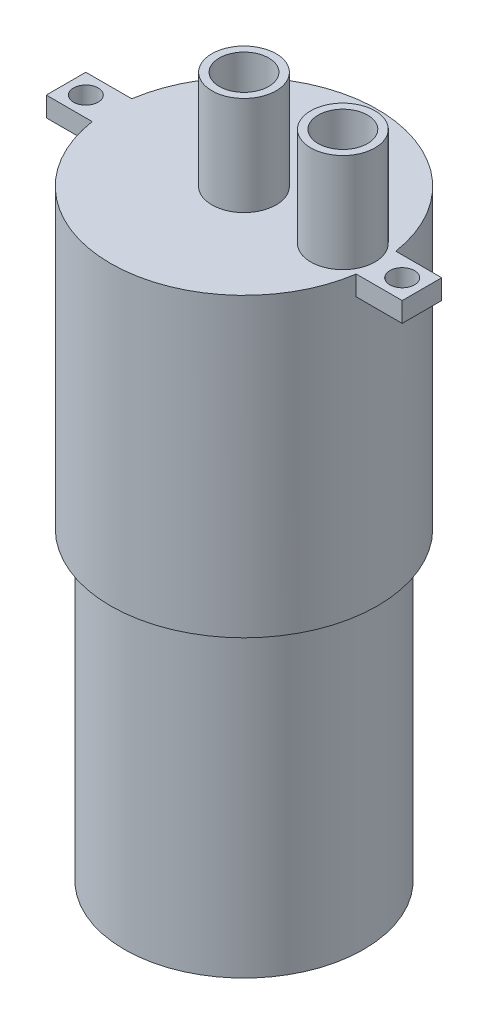
ISO-10303-21;
HEADER;
FILE_DESCRIPTION(('STEP AP214'),'2;1');
FILE_NAME('part.step','',(''),(''),'','','');
FILE_SCHEMA(('AUTOMOTIVE_DESIGN { 1 0 10303 214 1 1 1 1 }'));
ENDSEC;
DATA;
#1=APPLICATION_CONTEXT('core data for automotive mechanical design processes');
#2=APPLICATION_PROTOCOL_DEFINITION('international standard','automotive_design',2000,#1);
#3=PRODUCT_CONTEXT('',#1,'mechanical');
#4=PRODUCT('Part','Part','',(#3));
#5=PRODUCT_RELATED_PRODUCT_CATEGORY('part','',(#4));
#6=PRODUCT_DEFINITION_FORMATION('','',#4);
#7=PRODUCT_DEFINITION_CONTEXT('part definition',#1,'design');
#8=PRODUCT_DEFINITION('design','',#6,#7);
#9=PRODUCT_DEFINITION_SHAPE('','',#8);
#10=(LENGTH_UNIT() NAMED_UNIT(*) SI_UNIT(.MILLI.,.METRE.));
#11=(NAMED_UNIT(*) PLANE_ANGLE_UNIT() SI_UNIT($,.RADIAN.));
#12=(NAMED_UNIT(*) SI_UNIT($,.STERADIAN.) SOLID_ANGLE_UNIT());
#13=UNCERTAINTY_MEASURE_WITH_UNIT(LENGTH_MEASURE(1.E-05),#10,'distance_accuracy_value','');
#14=(GEOMETRIC_REPRESENTATION_CONTEXT(3) GLOBAL_UNCERTAINTY_ASSIGNED_CONTEXT((#13)) GLOBAL_UNIT_ASSIGNED_CONTEXT((#10,
#11,#12)) REPRESENTATION_CONTEXT('',''));
#15=CARTESIAN_POINT('',(0.,0.,0.));
#16=DIRECTION('',(0.,0.,1.));
#17=DIRECTION('',(1.,0.,0.));
#18=AXIS2_PLACEMENT_3D('',#15,#16,#17);
#19=CARTESIAN_POINT('',(0.,0.,0.));
#20=DIRECTION('',(0.,1.,0.));
#21=DIRECTION('',(0.,0.,1.));
#22=AXIS2_PLACEMENT_3D('',#19,#20,#21);
#23=PLANE('',#22);
#24=CARTESIAN_POINT('',(0.,0.,0.));
#25=DIRECTION('',(0.,1.,0.));
#26=DIRECTION('',(0.,0.,1.));
#27=AXIS2_PLACEMENT_3D('',#24,#25,#26);
#28=CIRCLE('',#27,12.1);
#29=CARTESIAN_POINT('',(0.,0.,12.1));
#30=VERTEX_POINT('',#29);
#31=EDGE_CURVE('E43',#30,#30,#28,.T.);
#32=ORIENTED_EDGE('',*,*,#31,.F.);
#33=EDGE_LOOP('',(#32));
#34=FACE_BOUND('',#33,.T.);
#35=ADVANCED_FACE('F36',(#34),#23,.F.);
#36=CARTESIAN_POINT('',(0.,12.3804050456273,0.));
#37=DIRECTION('',(0.,1.,0.));
#38=DIRECTION('',(0.,0.,1.));
#39=AXIS2_PLACEMENT_3D('',#36,#37,#38);
#40=CYLINDRICAL_SURFACE('',#39,12.1);
#41=CARTESIAN_POINT('',(0.,30.8,0.));
#42=DIRECTION('',(0.,1.,0.));
#43=DIRECTION('',(0.,0.,1.));
#44=AXIS2_PLACEMENT_3D('',#41,#42,#43);
#45=CIRCLE('',#44,12.1);
#46=CARTESIAN_POINT('',(0.,30.8,12.1));
#47=VERTEX_POINT('',#46);
#48=EDGE_CURVE('E202',#47,#47,#45,.T.);
#49=ORIENTED_EDGE('',*,*,#48,.F.);
#50=EDGE_LOOP('',(#49));
#51=FACE_BOUND('',#50,.T.);
#52=ORIENTED_EDGE('',*,*,#31,.T.);
#53=EDGE_LOOP('',(#52));
#54=FACE_BOUND('',#53,.T.);
#55=ADVANCED_FACE('F207',(#51,#54),#40,.T.);
#56=CARTESIAN_POINT('',(12.1,30.8,0.));
#57=DIRECTION('',(0.,1.,0.));
#58=DIRECTION('',(0.,0.,1.));
#59=AXIS2_PLACEMENT_3D('',#56,#57,#58);
#60=PLANE('',#59);
#61=CARTESIAN_POINT('',(0.,30.8,0.));
#62=DIRECTION('',(0.,1.,0.));
#63=DIRECTION('',(0.,0.,1.));
#64=AXIS2_PLACEMENT_3D('',#61,#62,#63);
#65=CIRCLE('',#64,13.5);
#66=CARTESIAN_POINT('',(0.,30.8,13.5));
#67=VERTEX_POINT('',#66);
#68=EDGE_CURVE('E199',#67,#67,#65,.T.);
#69=ORIENTED_EDGE('',*,*,#68,.F.);
#70=EDGE_LOOP('',(#69));
#71=FACE_BOUND('',#70,.T.);
#72=ORIENTED_EDGE('',*,*,#48,.T.);
#73=EDGE_LOOP('',(#72));
#74=FACE_BOUND('',#73,.T.);
#75=ADVANCED_FACE('F213',(#71,#74),#60,.F.);
#76=CARTESIAN_POINT('',(0.,12.3804050456273,0.));
#77=DIRECTION('',(0.,1.,0.));
#78=DIRECTION('',(0.,0.,1.));
#79=AXIS2_PLACEMENT_3D('',#76,#77,#78);
#80=CYLINDRICAL_SURFACE('',#79,13.5);
#81=CARTESIAN_POINT('',(0.,58.8,0.));
#82=DIRECTION('',(0.,-1.,0.));
#83=DIRECTION('',(0.,0.,1.));
#84=AXIS2_PLACEMENT_3D('',#81,#82,#83);
#85=CIRCLE('',#84,13.5);
#86=CARTESIAN_POINT('',(13.3510299228187,58.8,-2.));
#87=VERTEX_POINT('',#86);
#88=CARTESIAN_POINT('',(13.3510299228187,58.8,2.));
#89=VERTEX_POINT('',#88);
#90=EDGE_CURVE('E119',#87,#89,#85,.T.);
#91=ORIENTED_EDGE('',*,*,#90,.T.);
#92=DIRECTION('',(0.,1.,0.));
#93=VECTOR('',#92,1.);
#94=CARTESIAN_POINT('',(13.3510299228187,58.8,2.));
#95=LINE('',#94,#93);
#96=CARTESIAN_POINT('',(13.3510299228187,60.8,2.));
#97=VERTEX_POINT('',#96);
#98=EDGE_CURVE('E139',#89,#97,#95,.T.);
#99=ORIENTED_EDGE('',*,*,#98,.T.);
#100=CARTESIAN_POINT('',(0.,60.8,0.));
#101=DIRECTION('',(0.,1.,0.));
#102=DIRECTION('',(0.,0.,1.));
#103=AXIS2_PLACEMENT_3D('',#100,#101,#102);
#104=CIRCLE('',#103,13.5);
#105=CARTESIAN_POINT('',(-13.3510299228187,60.8,2.));
#106=VERTEX_POINT('',#105);
#107=EDGE_CURVE('E197',#106,#97,#104,.T.);
#108=ORIENTED_EDGE('',*,*,#107,.F.);
#109=DIRECTION('',(0.,1.,0.));
#110=VECTOR('',#109,1.);
#111=CARTESIAN_POINT('',(-13.3510299228187,58.8,1.99999999999999));
#112=LINE('',#111,#110);
#113=CARTESIAN_POINT('',(-13.3510299228187,58.8,1.99999999999999));
#114=VERTEX_POINT('',#113);
#115=EDGE_CURVE('E173',#114,#106,#112,.T.);
#116=ORIENTED_EDGE('',*,*,#115,.F.);
#117=CARTESIAN_POINT('',(0.,58.8,0.));
#118=DIRECTION('',(0.,-1.,0.));
#119=DIRECTION('',(0.,0.,1.));
#120=AXIS2_PLACEMENT_3D('',#117,#118,#119);
#121=CIRCLE('',#120,13.5);
#122=CARTESIAN_POINT('',(-13.3510299228187,58.8,-2.));
#123=VERTEX_POINT('',#122);
#124=EDGE_CURVE('E156',#114,#123,#121,.T.);
#125=ORIENTED_EDGE('',*,*,#124,.T.);
#126=DIRECTION('',(0.,1.,0.));
#127=VECTOR('',#126,1.);
#128=CARTESIAN_POINT('',(-13.3510299228187,58.8,-2.));
#129=LINE('',#128,#127);
#130=CARTESIAN_POINT('',(-13.3510299228187,60.8,-2.));
#131=VERTEX_POINT('',#130);
#132=EDGE_CURVE('E170',#123,#131,#129,.T.);
#133=ORIENTED_EDGE('',*,*,#132,.T.);
#134=CARTESIAN_POINT('',(13.3510299228187,60.8,-2.));
#135=VERTEX_POINT('',#134);
#136=EDGE_CURVE('E196',#135,#131,#104,.T.);
#137=ORIENTED_EDGE('',*,*,#136,.F.);
#138=DIRECTION('',(0.,1.,0.));
#139=VECTOR('',#138,1.);
#140=CARTESIAN_POINT('',(13.3510299228187,58.8,-2.));
#141=LINE('',#140,#139);
#142=EDGE_CURVE('E109',#87,#135,#141,.T.);
#143=ORIENTED_EDGE('',*,*,#142,.F.);
#144=EDGE_LOOP('',(#91,#99,#108,#116,#125,#133,#137,#143));
#145=FACE_BOUND('',#144,.T.);
#146=ORIENTED_EDGE('',*,*,#68,.T.);
#147=EDGE_LOOP('',(#146));
#148=FACE_BOUND('',#147,.T.);
#149=ADVANCED_FACE('F218',(#145,#148),#80,.T.);
#150=CARTESIAN_POINT('',(13.5,60.8,0.));
#151=DIRECTION('',(0.,-1.,0.));
#152=DIRECTION('',(0.,0.,-1.));
#153=AXIS2_PLACEMENT_3D('',#150,#151,#152);
#154=PLANE('',#153);
#155=CARTESIAN_POINT('',(10.,60.8,0.));
#156=DIRECTION('',(0.,-1.,0.));
#157=DIRECTION('',(0.,0.,-1.));
#158=AXIS2_PLACEMENT_3D('',#155,#156,#157);
#159=CIRCLE('',#158,3.25);
#160=CARTESIAN_POINT('',(10.,60.8,-3.25));
#161=VERTEX_POINT('',#160);
#162=EDGE_CURVE('E11',#161,#161,#159,.F.);
#163=ORIENTED_EDGE('',*,*,#162,.F.);
#164=EDGE_LOOP('',(#163));
#165=FACE_BOUND('',#164,.T.);
#166=CARTESIAN_POINT('',(0.,60.8,0.));
#167=DIRECTION('',(0.,1.,0.));
#168=DIRECTION('',(0.,0.,1.));
#169=AXIS2_PLACEMENT_3D('',#166,#167,#168);
#170=CIRCLE('',#169,3.25);
#171=CARTESIAN_POINT('',(0.,60.8,3.25));
#172=VERTEX_POINT('',#171);
#173=EDGE_CURVE('E193',#172,#172,#170,.T.);
#174=ORIENTED_EDGE('',*,*,#173,.F.);
#175=EDGE_LOOP('',(#174));
#176=FACE_BOUND('',#175,.T.);
#177=ORIENTED_EDGE('',*,*,#107,.T.);
#178=DIRECTION('',(1.,0.,0.));
#179=VECTOR('',#178,1.);
#180=CARTESIAN_POINT('',(18.,60.8,2.));
#181=LINE('',#180,#179);
#182=CARTESIAN_POINT('',(18.,60.8,2.));
#183=VERTEX_POINT('',#182);
#184=EDGE_CURVE('E123',#97,#183,#181,.T.);
#185=ORIENTED_EDGE('',*,*,#184,.T.);
#186=DIRECTION('',(0.,0.,-1.));
#187=VECTOR('',#186,1.);
#188=CARTESIAN_POINT('',(18.,60.8,2.));
#189=LINE('',#188,#187);
#190=CARTESIAN_POINT('',(18.,60.8,-2.));
#191=VERTEX_POINT('',#190);
#192=EDGE_CURVE('E133',#183,#191,#189,.T.);
#193=ORIENTED_EDGE('',*,*,#192,.T.);
#194=DIRECTION('',(-1.,0.,0.));
#195=VECTOR('',#194,1.);
#196=CARTESIAN_POINT('',(18.,60.8,-2.));
#197=LINE('',#196,#195);
#198=EDGE_CURVE('E50',#191,#135,#197,.T.);
#199=ORIENTED_EDGE('',*,*,#198,.T.);
#200=ORIENTED_EDGE('',*,*,#136,.T.);
#201=DIRECTION('',(-1.,0.,0.));
#202=VECTOR('',#201,1.);
#203=CARTESIAN_POINT('',(-13.3510299228187,60.8,-2.));
#204=LINE('',#203,#202);
#205=CARTESIAN_POINT('',(-18.,60.8,-2.));
#206=VERTEX_POINT('',#205);
#207=EDGE_CURVE('E153',#131,#206,#204,.T.);
#208=ORIENTED_EDGE('',*,*,#207,.T.);
#209=DIRECTION('',(0.,0.,1.));
#210=VECTOR('',#209,1.);
#211=CARTESIAN_POINT('',(-18.,60.8,2.));
#212=LINE('',#211,#210);
#213=CARTESIAN_POINT('',(-18.,60.8,2.));
#214=VERTEX_POINT('',#213);
#215=EDGE_CURVE('E146',#206,#214,#212,.T.);
#216=ORIENTED_EDGE('',*,*,#215,.T.);
#217=DIRECTION('',(1.,0.,0.));
#218=VECTOR('',#217,1.);
#219=CARTESIAN_POINT('',(-13.3510299228187,60.8,2.));
#220=LINE('',#219,#218);
#221=EDGE_CURVE('E57',#214,#106,#220,.T.);
#222=ORIENTED_EDGE('',*,*,#221,.T.);
#223=EDGE_LOOP('',(#177,#185,#193,#199,#200,#208,#216,#222));
#224=FACE_BOUND('',#223,.T.);
#225=CARTESIAN_POINT('',(-16.,60.8,0.));
#226=DIRECTION('',(0.,1.,0.));
#227=DIRECTION('',(0.,0.,1.));
#228=AXIS2_PLACEMENT_3D('',#225,#226,#227);
#229=CIRCLE('',#228,1.25);
#230=CARTESIAN_POINT('',(-16.,60.8,1.25));
#231=VERTEX_POINT('',#230);
#232=EDGE_CURVE('E138',#231,#231,#229,.T.);
#233=ORIENTED_EDGE('',*,*,#232,.F.);
#234=EDGE_LOOP('',(#233));
#235=FACE_BOUND('',#234,.T.);
#236=CARTESIAN_POINT('',(16.,60.8,0.));
#237=DIRECTION('',(0.,1.,0.));
#238=DIRECTION('',(0.,0.,1.));
#239=AXIS2_PLACEMENT_3D('',#236,#237,#238);
#240=CIRCLE('',#239,1.25);
#241=CARTESIAN_POINT('',(16.,60.8,1.25));
#242=VERTEX_POINT('',#241);
#243=EDGE_CURVE('E128',#242,#242,#240,.T.);
#244=ORIENTED_EDGE('',*,*,#243,.F.);
#245=EDGE_LOOP('',(#244));
#246=FACE_BOUND('',#245,.T.);
#247=ADVANCED_FACE('F225',(#165,#176,#224,#235,#246),#154,.F.);
#248=CARTESIAN_POINT('',(0.,12.3804050456273,0.));
#249=DIRECTION('',(0.,1.,0.));
#250=DIRECTION('',(0.,0.,1.));
#251=AXIS2_PLACEMENT_3D('',#248,#249,#250);
#252=CYLINDRICAL_SURFACE('',#251,3.25);
#253=CARTESIAN_POINT('',(0.,70.8,0.));
#254=DIRECTION('',(0.,1.,0.));
#255=DIRECTION('',(0.,0.,1.));
#256=AXIS2_PLACEMENT_3D('',#253,#254,#255);
#257=CIRCLE('',#256,3.24999999999999);
#258=CARTESIAN_POINT('',(0.,70.8,3.24999999999999));
#259=VERTEX_POINT('',#258);
#260=EDGE_CURVE('E190',#259,#259,#257,.T.);
#261=ORIENTED_EDGE('',*,*,#260,.F.);
#262=EDGE_LOOP('',(#261));
#263=FACE_BOUND('',#262,.T.);
#264=ORIENTED_EDGE('',*,*,#173,.T.);
#265=EDGE_LOOP('',(#264));
#266=FACE_BOUND('',#265,.T.);
#267=ADVANCED_FACE('F229',(#263,#266),#252,.T.);
#268=CARTESIAN_POINT('',(3.24999999999999,70.8,0.));
#269=DIRECTION('',(0.,-1.,0.));
#270=DIRECTION('',(0.,0.,-1.));
#271=AXIS2_PLACEMENT_3D('',#268,#269,#270);
#272=PLANE('',#271);
#273=CARTESIAN_POINT('',(0.,70.8,0.));
#274=DIRECTION('',(0.,1.,0.));
#275=DIRECTION('',(0.,0.,1.));
#276=AXIS2_PLACEMENT_3D('',#273,#274,#275);
#277=CIRCLE('',#276,2.49999999999999);
#278=CARTESIAN_POINT('',(0.,70.8,2.49999999999999));
#279=VERTEX_POINT('',#278);
#280=EDGE_CURVE('E187',#279,#279,#277,.T.);
#281=ORIENTED_EDGE('',*,*,#280,.F.);
#282=EDGE_LOOP('',(#281));
#283=FACE_BOUND('',#282,.T.);
#284=ORIENTED_EDGE('',*,*,#260,.T.);
#285=EDGE_LOOP('',(#284));
#286=FACE_BOUND('',#285,.T.);
#287=ADVANCED_FACE('F234',(#283,#286),#272,.F.);
#288=CARTESIAN_POINT('',(0.,12.3804050456273,0.));
#289=DIRECTION('',(0.,1.,0.));
#290=DIRECTION('',(0.,0.,1.));
#291=AXIS2_PLACEMENT_3D('',#288,#289,#290);
#292=CYLINDRICAL_SURFACE('',#291,2.49999999999999);
#293=CARTESIAN_POINT('',(0.,62.8,0.));
#294=DIRECTION('',(0.,1.,0.));
#295=DIRECTION('',(0.,0.,1.));
#296=AXIS2_PLACEMENT_3D('',#293,#294,#295);
#297=CIRCLE('',#296,2.5);
#298=CARTESIAN_POINT('',(0.,62.8,2.5));
#299=VERTEX_POINT('',#298);
#300=EDGE_CURVE('E184',#299,#299,#297,.T.);
#301=ORIENTED_EDGE('',*,*,#300,.F.);
#302=EDGE_LOOP('',(#301));
#303=FACE_BOUND('',#302,.T.);
#304=ORIENTED_EDGE('',*,*,#280,.T.);
#305=EDGE_LOOP('',(#304));
#306=FACE_BOUND('',#305,.T.);
#307=ADVANCED_FACE('F238',(#303,#306),#292,.F.);
#308=CARTESIAN_POINT('',(2.5,62.8,0.));
#309=DIRECTION('',(0.,-1.,0.));
#310=DIRECTION('',(0.,0.,-1.));
#311=AXIS2_PLACEMENT_3D('',#308,#309,#310);
#312=PLANE('',#311);
#313=ORIENTED_EDGE('',*,*,#300,.T.);
#314=EDGE_LOOP('',(#313));
#315=FACE_BOUND('',#314,.T.);
#316=ADVANCED_FACE('F242',(#315),#312,.F.);
#317=CARTESIAN_POINT('',(10.,79.9923881554251,0.));
#318=DIRECTION('',(0.,-1.,0.));
#319=DIRECTION('',(0.,0.,-1.));
#320=AXIS2_PLACEMENT_3D('',#317,#318,#319);
#321=CYLINDRICAL_SURFACE('',#320,3.25);
#322=CARTESIAN_POINT('',(10.,70.8,0.));
#323=DIRECTION('',(0.,-1.,0.));
#324=DIRECTION('',(0.,0.,-1.));
#325=AXIS2_PLACEMENT_3D('',#322,#323,#324);
#326=CIRCLE('',#325,3.25);
#327=CARTESIAN_POINT('',(10.,70.8,-3.25));
#328=VERTEX_POINT('',#327);
#329=EDGE_CURVE('E178',#328,#328,#326,.T.);
#330=ORIENTED_EDGE('',*,*,#329,.T.);
#331=EDGE_LOOP('',(#330));
#332=FACE_BOUND('',#331,.T.);
#333=ORIENTED_EDGE('',*,*,#162,.T.);
#334=EDGE_LOOP('',(#333));
#335=FACE_BOUND('',#334,.T.);
#336=ADVANCED_FACE('F246',(#332,#335),#321,.T.);
#337=CARTESIAN_POINT('',(10.,79.9923881554251,0.));
#338=DIRECTION('',(0.,-1.,0.));
#339=DIRECTION('',(0.,0.,-1.));
#340=AXIS2_PLACEMENT_3D('',#337,#338,#339);
#341=CYLINDRICAL_SURFACE('',#340,2.49999999999999);
#342=CARTESIAN_POINT('',(10.,70.8,0.));
#343=DIRECTION('',(0.,-1.,0.));
#344=DIRECTION('',(0.,0.,-1.));
#345=AXIS2_PLACEMENT_3D('',#342,#343,#344);
#346=CIRCLE('',#345,2.49999999999999);
#347=CARTESIAN_POINT('',(10.,70.8,-2.49999999999999));
#348=VERTEX_POINT('',#347);
#349=EDGE_CURVE('E181',#348,#348,#346,.T.);
#350=ORIENTED_EDGE('',*,*,#349,.F.);
#351=EDGE_LOOP('',(#350));
#352=FACE_BOUND('',#351,.T.);
#353=CARTESIAN_POINT('',(10.,60.8,0.));
#354=DIRECTION('',(0.,1.,0.));
#355=DIRECTION('',(0.,0.,1.));
#356=AXIS2_PLACEMENT_3D('',#353,#354,#355);
#357=CIRCLE('',#356,2.49999999999999);
#358=CARTESIAN_POINT('',(10.,60.8,2.49999999999999));
#359=VERTEX_POINT('',#358);
#360=EDGE_CURVE('E169',#359,#359,#357,.T.);
#361=ORIENTED_EDGE('',*,*,#360,.F.);
#362=EDGE_LOOP('',(#361));
#363=FACE_BOUND('',#362,.T.);
#364=ADVANCED_FACE('F251',(#352,#363),#341,.F.);
#365=CARTESIAN_POINT('',(3.24999999999999,70.8,0.));
#366=DIRECTION('',(0.,-1.,0.));
#367=DIRECTION('',(0.,0.,-1.));
#368=AXIS2_PLACEMENT_3D('',#365,#366,#367);
#369=PLANE('',#368);
#370=ORIENTED_EDGE('',*,*,#349,.T.);
#371=EDGE_LOOP('',(#370));
#372=FACE_BOUND('',#371,.T.);
#373=ORIENTED_EDGE('',*,*,#329,.F.);
#374=EDGE_LOOP('',(#373));
#375=FACE_BOUND('',#374,.T.);
#376=ADVANCED_FACE('F248',(#372,#375),#369,.F.);
#377=ORIENTED_EDGE('',*,*,#360,.T.);
#378=EDGE_LOOP('',(#377));
#379=FACE_BOUND('',#378,.T.);
#380=ADVANCED_FACE('F231',(#379),#154,.F.);
#381=CARTESIAN_POINT('',(-18.,58.8,2.));
#382=DIRECTION('',(-1.,0.,0.));
#383=DIRECTION('',(0.,0.,1.));
#384=AXIS2_PLACEMENT_3D('',#381,#382,#383);
#385=PLANE('',#384);
#386=ORIENTED_EDGE('',*,*,#215,.F.);
#387=DIRECTION('',(0.,1.,0.));
#388=VECTOR('',#387,1.);
#389=CARTESIAN_POINT('',(-18.,58.8,-2.));
#390=LINE('',#389,#388);
#391=CARTESIAN_POINT('',(-18.,58.8,-2.));
#392=VERTEX_POINT('',#391);
#393=EDGE_CURVE('E167',#392,#206,#390,.T.);
#394=ORIENTED_EDGE('',*,*,#393,.F.);
#395=DIRECTION('',(0.,0.,1.));
#396=VECTOR('',#395,1.);
#397=CARTESIAN_POINT('',(-18.,58.8,2.));
#398=LINE('',#397,#396);
#399=CARTESIAN_POINT('',(-18.,58.8,2.));
#400=VERTEX_POINT('',#399);
#401=EDGE_CURVE('E149',#392,#400,#398,.T.);
#402=ORIENTED_EDGE('',*,*,#401,.T.);
#403=DIRECTION('',(0.,1.,0.));
#404=VECTOR('',#403,1.);
#405=CARTESIAN_POINT('',(-18.,58.8,2.));
#406=LINE('',#405,#404);
#407=EDGE_CURVE('E162',#400,#214,#406,.T.);
#408=ORIENTED_EDGE('',*,*,#407,.T.);
#409=EDGE_LOOP('',(#386,#394,#402,#408));
#410=FACE_BOUND('',#409,.T.);
#411=ADVANCED_FACE('F259',(#410),#385,.T.);
#412=CARTESIAN_POINT('',(-13.3510299228187,58.8,-2.));
#413=DIRECTION('',(0.,0.,-1.));
#414=DIRECTION('',(-1.,0.,0.));
#415=AXIS2_PLACEMENT_3D('',#412,#413,#414);
#416=PLANE('',#415);
#417=ORIENTED_EDGE('',*,*,#207,.F.);
#418=ORIENTED_EDGE('',*,*,#132,.F.);
#419=DIRECTION('',(-1.,0.,0.));
#420=VECTOR('',#419,1.);
#421=CARTESIAN_POINT('',(-13.3510299228187,58.8,-2.));
#422=LINE('',#421,#420);
#423=EDGE_CURVE('E159',#123,#392,#422,.T.);
#424=ORIENTED_EDGE('',*,*,#423,.T.);
#425=ORIENTED_EDGE('',*,*,#393,.T.);
#426=EDGE_LOOP('',(#417,#418,#424,#425));
#427=FACE_BOUND('',#426,.T.);
#428=ADVANCED_FACE('F262',(#427),#416,.T.);
#429=CARTESIAN_POINT('',(-13.3510299228187,58.8,2.));
#430=DIRECTION('',(0.,0.,1.));
#431=DIRECTION('',(1.,0.,0.));
#432=AXIS2_PLACEMENT_3D('',#429,#430,#431);
#433=PLANE('',#432);
#434=ORIENTED_EDGE('',*,*,#221,.F.);
#435=ORIENTED_EDGE('',*,*,#407,.F.);
#436=DIRECTION('',(1.,0.,0.));
#437=VECTOR('',#436,1.);
#438=CARTESIAN_POINT('',(-13.3510299228187,58.8,2.));
#439=LINE('',#438,#437);
#440=EDGE_CURVE('E152',#400,#114,#439,.T.);
#441=ORIENTED_EDGE('',*,*,#440,.T.);
#442=ORIENTED_EDGE('',*,*,#115,.T.);
#443=EDGE_LOOP('',(#434,#435,#441,#442));
#444=FACE_BOUND('',#443,.T.);
#445=ADVANCED_FACE('F264',(#444),#433,.T.);
#446=CARTESIAN_POINT('',(0.,58.8,0.));
#447=DIRECTION('',(0.,1.,0.));
#448=DIRECTION('',(0.,0.,1.));
#449=AXIS2_PLACEMENT_3D('',#446,#447,#448);
#450=PLANE('',#449);
#451=CARTESIAN_POINT('',(-16.,58.8,0.));
#452=DIRECTION('',(0.,1.,0.));
#453=DIRECTION('',(0.,0.,1.));
#454=AXIS2_PLACEMENT_3D('',#451,#452,#453);
#455=CIRCLE('',#454,1.25);
#456=CARTESIAN_POINT('',(-16.,58.8,1.25));
#457=VERTEX_POINT('',#456);
#458=EDGE_CURVE('E143',#457,#457,#455,.T.);
#459=ORIENTED_EDGE('',*,*,#458,.T.);
#460=EDGE_LOOP('',(#459));
#461=FACE_BOUND('',#460,.T.);
#462=ORIENTED_EDGE('',*,*,#401,.F.);
#463=ORIENTED_EDGE('',*,*,#423,.F.);
#464=ORIENTED_EDGE('',*,*,#124,.F.);
#465=ORIENTED_EDGE('',*,*,#440,.F.);
#466=EDGE_LOOP('',(#462,#463,#464,#465));
#467=FACE_BOUND('',#466,.T.);
#468=ADVANCED_FACE('F267',(#461,#467),#450,.F.);
#469=CARTESIAN_POINT('',(-16.,58.8,0.));
#470=DIRECTION('',(0.,1.,0.));
#471=DIRECTION('',(0.,0.,1.));
#472=AXIS2_PLACEMENT_3D('',#469,#470,#471);
#473=CYLINDRICAL_SURFACE('',#472,1.25);
#474=ORIENTED_EDGE('',*,*,#458,.F.);
#475=EDGE_LOOP('',(#474));
#476=FACE_BOUND('',#475,.T.);
#477=ORIENTED_EDGE('',*,*,#232,.T.);
#478=EDGE_LOOP('',(#477));
#479=FACE_BOUND('',#478,.T.);
#480=ADVANCED_FACE('F274',(#476,#479),#473,.F.);
#481=CARTESIAN_POINT('',(18.,58.8,2.));
#482=DIRECTION('',(1.,0.,0.));
#483=DIRECTION('',(0.,0.,-1.));
#484=AXIS2_PLACEMENT_3D('',#481,#482,#483);
#485=PLANE('',#484);
#486=ORIENTED_EDGE('',*,*,#192,.F.);
#487=DIRECTION('',(0.,1.,0.));
#488=VECTOR('',#487,1.);
#489=CARTESIAN_POINT('',(18.,58.8,2.));
#490=LINE('',#489,#488);
#491=CARTESIAN_POINT('',(18.,58.8,2.));
#492=VERTEX_POINT('',#491);
#493=EDGE_CURVE('E122',#492,#183,#490,.T.);
#494=ORIENTED_EDGE('',*,*,#493,.F.);
#495=DIRECTION('',(0.,0.,-1.));
#496=VECTOR('',#495,1.);
#497=CARTESIAN_POINT('',(18.,58.8,2.));
#498=LINE('',#497,#496);
#499=CARTESIAN_POINT('',(18.,58.8,-2.));
#500=VERTEX_POINT('',#499);
#501=EDGE_CURVE('E116',#492,#500,#498,.T.);
#502=ORIENTED_EDGE('',*,*,#501,.T.);
#503=DIRECTION('',(0.,1.,0.));
#504=VECTOR('',#503,1.);
#505=CARTESIAN_POINT('',(18.,58.8,-2.));
#506=LINE('',#505,#504);
#507=EDGE_CURVE('E101',#500,#191,#506,.T.);
#508=ORIENTED_EDGE('',*,*,#507,.T.);
#509=EDGE_LOOP('',(#486,#494,#502,#508));
#510=FACE_BOUND('',#509,.T.);
#511=ADVANCED_FACE('F121',(#510),#485,.T.);
#512=CARTESIAN_POINT('',(18.,58.8,2.));
#513=DIRECTION('',(0.,0.,1.));
#514=DIRECTION('',(1.,0.,0.));
#515=AXIS2_PLACEMENT_3D('',#512,#513,#514);
#516=PLANE('',#515);
#517=ORIENTED_EDGE('',*,*,#184,.F.);
#518=ORIENTED_EDGE('',*,*,#98,.F.);
#519=DIRECTION('',(1.,0.,0.));
#520=VECTOR('',#519,1.);
#521=CARTESIAN_POINT('',(18.,58.8,2.));
#522=LINE('',#521,#520);
#523=EDGE_CURVE('E110',#89,#492,#522,.T.);
#524=ORIENTED_EDGE('',*,*,#523,.T.);
#525=ORIENTED_EDGE('',*,*,#493,.T.);
#526=EDGE_LOOP('',(#517,#518,#524,#525));
#527=FACE_BOUND('',#526,.T.);
#528=ADVANCED_FACE('F281',(#527),#516,.T.);
#529=CARTESIAN_POINT('',(18.,58.8,-2.));
#530=DIRECTION('',(0.,0.,-1.));
#531=DIRECTION('',(-1.,0.,0.));
#532=AXIS2_PLACEMENT_3D('',#529,#530,#531);
#533=PLANE('',#532);
#534=ORIENTED_EDGE('',*,*,#198,.F.);
#535=ORIENTED_EDGE('',*,*,#507,.F.);
#536=DIRECTION('',(-1.,0.,0.));
#537=VECTOR('',#536,1.);
#538=CARTESIAN_POINT('',(18.,58.8,-2.));
#539=LINE('',#538,#537);
#540=EDGE_CURVE('E104',#500,#87,#539,.T.);
#541=ORIENTED_EDGE('',*,*,#540,.T.);
#542=ORIENTED_EDGE('',*,*,#142,.T.);
#543=EDGE_LOOP('',(#534,#535,#541,#542));
#544=FACE_BOUND('',#543,.T.);
#545=ADVANCED_FACE('F103',(#544),#533,.T.);
#546=CARTESIAN_POINT('',(0.,58.8,0.));
#547=DIRECTION('',(0.,1.,0.));
#548=DIRECTION('',(0.,0.,1.));
#549=AXIS2_PLACEMENT_3D('',#546,#547,#548);
#550=PLANE('',#549);
#551=CARTESIAN_POINT('',(16.,58.8,0.));
#552=DIRECTION('',(0.,1.,0.));
#553=DIRECTION('',(0.,0.,1.));
#554=AXIS2_PLACEMENT_3D('',#551,#552,#553);
#555=CIRCLE('',#554,1.25);
#556=CARTESIAN_POINT('',(16.,58.8,1.25));
#557=VERTEX_POINT('',#556);
#558=EDGE_CURVE('E135',#557,#557,#555,.T.);
#559=ORIENTED_EDGE('',*,*,#558,.T.);
#560=EDGE_LOOP('',(#559));
#561=FACE_BOUND('',#560,.T.);
#562=ORIENTED_EDGE('',*,*,#501,.F.);
#563=ORIENTED_EDGE('',*,*,#523,.F.);
#564=ORIENTED_EDGE('',*,*,#90,.F.);
#565=ORIENTED_EDGE('',*,*,#540,.F.);
#566=EDGE_LOOP('',(#562,#563,#564,#565));
#567=FACE_BOUND('',#566,.T.);
#568=ADVANCED_FACE('F114',(#561,#567),#550,.F.);
#569=CARTESIAN_POINT('',(16.,58.8,0.));
#570=DIRECTION('',(0.,1.,0.));
#571=DIRECTION('',(0.,0.,1.));
#572=AXIS2_PLACEMENT_3D('',#569,#570,#571);
#573=CYLINDRICAL_SURFACE('',#572,1.25);
#574=ORIENTED_EDGE('',*,*,#558,.F.);
#575=EDGE_LOOP('',(#574));
#576=FACE_BOUND('',#575,.T.);
#577=ORIENTED_EDGE('',*,*,#243,.T.);
#578=EDGE_LOOP('',(#577));
#579=FACE_BOUND('',#578,.T.);
#580=ADVANCED_FACE('F289',(#576,#579),#573,.F.);
#581=CLOSED_SHELL('',(#35,#55,#75,#149,#247,#267,#287,#307,#316,#336,#364,#376,#380,#411,#428,
#445,#468,#480,#511,#528,#545,#568,#580));
#582=MANIFOLD_SOLID_BREP('B2',#581);
#583=ADVANCED_BREP_SHAPE_REPRESENTATION('',(#18,#582),#14);
#584=SHAPE_DEFINITION_REPRESENTATION(#9,#583);
ENDSEC;
END-ISO-10303-21;
